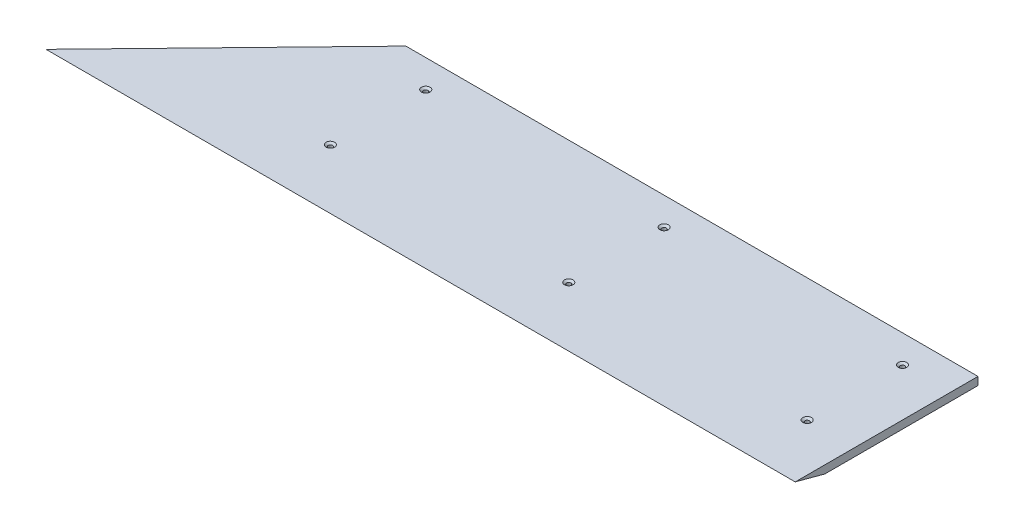
ISO-10303-21;
HEADER;
FILE_DESCRIPTION(('STEP AP214'),'2;1');
FILE_NAME('part.step','',(''),(''),'','','');
FILE_SCHEMA(('AUTOMOTIVE_DESIGN { 1 0 10303 214 1 1 1 1 }'));
ENDSEC;
DATA;
#1=APPLICATION_CONTEXT('core data for automotive mechanical design processes');
#2=APPLICATION_PROTOCOL_DEFINITION('international standard','automotive_design',2000,#1);
#3=PRODUCT_CONTEXT('',#1,'mechanical');
#4=PRODUCT('Part','Part','',(#3));
#5=PRODUCT_RELATED_PRODUCT_CATEGORY('part','',(#4));
#6=PRODUCT_DEFINITION_FORMATION('','',#4);
#7=PRODUCT_DEFINITION_CONTEXT('part definition',#1,'design');
#8=PRODUCT_DEFINITION('design','',#6,#7);
#9=PRODUCT_DEFINITION_SHAPE('','',#8);
#10=(LENGTH_UNIT() NAMED_UNIT(*) SI_UNIT(.MILLI.,.METRE.));
#11=(NAMED_UNIT(*) PLANE_ANGLE_UNIT() SI_UNIT($,.RADIAN.));
#12=(NAMED_UNIT(*) SI_UNIT($,.STERADIAN.) SOLID_ANGLE_UNIT());
#13=UNCERTAINTY_MEASURE_WITH_UNIT(LENGTH_MEASURE(1.E-05),#10,'distance_accuracy_value','');
#14=(GEOMETRIC_REPRESENTATION_CONTEXT(3) GLOBAL_UNCERTAINTY_ASSIGNED_CONTEXT((#13)) GLOBAL_UNIT_ASSIGNED_CONTEXT((#10,
#11,#12)) REPRESENTATION_CONTEXT('',''));
#15=CARTESIAN_POINT('',(0.,0.,0.));
#16=DIRECTION('',(0.,0.,1.));
#17=DIRECTION('',(1.,0.,0.));
#18=AXIS2_PLACEMENT_3D('',#15,#16,#17);
#19=CARTESIAN_POINT('',(381.,12.7,196.85));
#20=DIRECTION('',(0.,1.,0.));
#21=DIRECTION('',(0.,0.,1.));
#22=AXIS2_PLACEMENT_3D('',#19,#20,#21);
#23=CONICAL_SURFACE('',#22,6.85799999999998,0.872664625997165);
#24=CARTESIAN_POINT('',(381.,9.94208089623176,196.85));
#25=DIRECTION('',(0.,1.,0.));
#26=DIRECTION('',(0.,0.,1.));
#27=AXIS2_PLACEMENT_3D('',#24,#25,#26);
#28=CIRCLE('',#27,3.57123999999998);
#29=CARTESIAN_POINT('',(381.,9.94208089623176,200.42124));
#30=VERTEX_POINT('',#29);
#31=EDGE_CURVE('E11',#30,#30,#28,.T.);
#32=ORIENTED_EDGE('',*,*,#31,.F.);
#33=EDGE_LOOP('',(#32));
#34=FACE_BOUND('',#33,.T.);
#35=CARTESIAN_POINT('',(381.,12.7,196.85));
#36=DIRECTION('',(0.,1.,0.));
#37=DIRECTION('',(0.,0.,1.));
#38=AXIS2_PLACEMENT_3D('',#35,#36,#37);
#39=CIRCLE('',#38,6.85799999999998);
#40=CARTESIAN_POINT('',(381.,12.7,203.708));
#41=VERTEX_POINT('',#40);
#42=EDGE_CURVE('E120',#41,#41,#39,.T.);
#43=ORIENTED_EDGE('',*,*,#42,.T.);
#44=EDGE_LOOP('',(#43));
#45=FACE_BOUND('',#44,.T.);
#46=ADVANCED_FACE('F32',(#34,#45),#23,.F.);
#47=CARTESIAN_POINT('',(381.,12.7,196.85));
#48=DIRECTION('',(0.,1.,0.));
#49=DIRECTION('',(0.,0.,1.));
#50=AXIS2_PLACEMENT_3D('',#47,#48,#49);
#51=CYLINDRICAL_SURFACE('',#50,3.57123999999998);
#52=CARTESIAN_POINT('',(381.,0.,196.85));
#53=DIRECTION('',(0.,1.,0.));
#54=DIRECTION('',(0.,0.,1.));
#55=AXIS2_PLACEMENT_3D('',#52,#53,#54);
#56=CIRCLE('',#55,3.57123999999998);
#57=CARTESIAN_POINT('',(381.,0.,200.42124));
#58=VERTEX_POINT('',#57);
#59=EDGE_CURVE('E39',#58,#58,#56,.T.);
#60=ORIENTED_EDGE('',*,*,#59,.F.);
#61=EDGE_LOOP('',(#60));
#62=FACE_BOUND('',#61,.T.);
#63=ORIENTED_EDGE('',*,*,#31,.T.);
#64=EDGE_LOOP('',(#63));
#65=FACE_BOUND('',#64,.T.);
#66=ADVANCED_FACE('F127',(#62,#65),#51,.F.);
#67=CARTESIAN_POINT('',(381.,12.7,44.4499999999998));
#68=DIRECTION('',(0.,1.,0.));
#69=DIRECTION('',(0.,0.,1.));
#70=AXIS2_PLACEMENT_3D('',#67,#68,#69);
#71=CONICAL_SURFACE('',#70,6.85799999999998,0.872664625997165);
#72=CARTESIAN_POINT('',(381.,9.94208089623176,44.4499999999998));
#73=DIRECTION('',(0.,1.,0.));
#74=DIRECTION('',(0.,0.,1.));
#75=AXIS2_PLACEMENT_3D('',#72,#73,#74);
#76=CIRCLE('',#75,3.57123999999998);
#77=CARTESIAN_POINT('',(381.,9.94208089623176,48.0212399999997));
#78=VERTEX_POINT('',#77);
#79=EDGE_CURVE('E117',#78,#78,#76,.T.);
#80=ORIENTED_EDGE('',*,*,#79,.F.);
#81=EDGE_LOOP('',(#80));
#82=FACE_BOUND('',#81,.T.);
#83=CARTESIAN_POINT('',(381.,12.7,44.4499999999998));
#84=DIRECTION('',(0.,1.,0.));
#85=DIRECTION('',(0.,0.,1.));
#86=AXIS2_PLACEMENT_3D('',#83,#84,#85);
#87=CIRCLE('',#86,6.85799999999998);
#88=CARTESIAN_POINT('',(381.,12.7,51.3079999999997));
#89=VERTEX_POINT('',#88);
#90=EDGE_CURVE('E81',#89,#89,#87,.T.);
#91=ORIENTED_EDGE('',*,*,#90,.T.);
#92=EDGE_LOOP('',(#91));
#93=FACE_BOUND('',#92,.T.);
#94=ADVANCED_FACE('F130',(#82,#93),#71,.F.);
#95=CARTESIAN_POINT('',(381.,12.7,44.4499999999998));
#96=DIRECTION('',(0.,1.,0.));
#97=DIRECTION('',(0.,0.,1.));
#98=AXIS2_PLACEMENT_3D('',#95,#96,#97);
#99=CYLINDRICAL_SURFACE('',#98,3.57123999999998);
#100=CARTESIAN_POINT('',(381.,0.,44.4499999999998));
#101=DIRECTION('',(0.,1.,0.));
#102=DIRECTION('',(0.,0.,1.));
#103=AXIS2_PLACEMENT_3D('',#100,#101,#102);
#104=CIRCLE('',#103,3.57123999999998);
#105=CARTESIAN_POINT('',(381.,0.,48.0212399999997));
#106=VERTEX_POINT('',#105);
#107=EDGE_CURVE('E114',#106,#106,#104,.T.);
#108=ORIENTED_EDGE('',*,*,#107,.F.);
#109=EDGE_LOOP('',(#108));
#110=FACE_BOUND('',#109,.T.);
#111=ORIENTED_EDGE('',*,*,#79,.T.);
#112=EDGE_LOOP('',(#111));
#113=FACE_BOUND('',#112,.T.);
#114=ADVANCED_FACE('F160',(#110,#113),#99,.F.);
#115=CARTESIAN_POINT('',(-740.26459256231,12.7,292.1));
#116=DIRECTION('',(0.718126297763185,0.,0.695912796592318));
#117=DIRECTION('',(0.695912796592318,0.,-0.718126297763185));
#118=AXIS2_PLACEMENT_3D('',#115,#116,#117);
#119=PLANE('',#118);
#120=DIRECTION('',(-0.695912796592318,0.,0.718126297763185));
#121=VECTOR('',#120,1.);
#122=CARTESIAN_POINT('',(-740.26459256231,0.,292.1));
#123=LINE('',#122,#121);
#124=CARTESIAN_POINT('',(-457.2,0.,0.));
#125=VERTEX_POINT('',#124);
#126=CARTESIAN_POINT('',(-694.33366033334,0.,244.702954743876));
#127=VERTEX_POINT('',#126);
#128=EDGE_CURVE('E78',#125,#127,#123,.T.);
#129=ORIENTED_EDGE('',*,*,#128,.T.);
#130=DIRECTION('',(-0.683376443185712,0.188955033292019,0.705189784591678));
#131=VECTOR('',#130,1.);
#132=CARTESIAN_POINT('',(-181.044600641157,-141.925511670305,-284.970265699909));
#133=LINE('',#132,#131);
#134=CARTESIAN_POINT('',(-740.26459256231,12.7,292.1));
#135=VERTEX_POINT('',#134);
#136=EDGE_CURVE('E73',#127,#135,#133,.T.);
#137=ORIENTED_EDGE('',*,*,#136,.T.);
#138=DIRECTION('',(-0.695912796592318,0.,0.718126297763185));
#139=VECTOR('',#138,1.);
#140=CARTESIAN_POINT('',(-740.26459256231,12.7,292.1));
#141=LINE('',#140,#139);
#142=CARTESIAN_POINT('',(-457.2,12.7,0.));
#143=VERTEX_POINT('',#142);
#144=EDGE_CURVE('E77',#143,#135,#141,.T.);
#145=ORIENTED_EDGE('',*,*,#144,.F.);
#146=DIRECTION('',(0.,-1.,0.));
#147=VECTOR('',#146,1.);
#148=CARTESIAN_POINT('',(-457.2,12.7,0.));
#149=LINE('',#148,#147);
#150=EDGE_CURVE('E100',#143,#125,#149,.T.);
#151=ORIENTED_EDGE('',*,*,#150,.T.);
#152=EDGE_LOOP('',(#129,#137,#145,#151));
#153=FACE_BOUND('',#152,.T.);
#154=ADVANCED_FACE('F75',(#153),#119,.F.);
#155=CARTESIAN_POINT('',(457.2,12.7,-1.67972554971051E-13));
#156=DIRECTION('',(-1.,0.,0.));
#157=DIRECTION('',(0.,0.,1.));
#158=AXIS2_PLACEMENT_3D('',#155,#156,#157);
#159=PLANE('',#158);
#160=DIRECTION('',(0.,0.,-1.));
#161=VECTOR('',#160,1.);
#162=CARTESIAN_POINT('',(457.2,12.7,-1.67972554971051E-13));
#163=LINE('',#162,#161);
#164=CARTESIAN_POINT('',(457.2,12.7,292.1));
#165=VERTEX_POINT('',#164);
#166=CARTESIAN_POINT('',(457.2,12.7,-1.67972554971051E-13));
#167=VERTEX_POINT('',#166);
#168=EDGE_CURVE('E94',#165,#167,#163,.T.);
#169=ORIENTED_EDGE('',*,*,#168,.F.);
#170=DIRECTION('',(0.,-0.258819045102523,-0.965925826289068));
#171=VECTOR('',#170,1.);
#172=CARTESIAN_POINT('',(457.2,12.7,292.1));
#173=LINE('',#172,#171);
#174=CARTESIAN_POINT('',(457.2,0.,244.702954743876));
#175=VERTEX_POINT('',#174);
#176=EDGE_CURVE('E54',#165,#175,#173,.T.);
#177=ORIENTED_EDGE('',*,*,#176,.T.);
#178=DIRECTION('',(0.,0.,-1.));
#179=VECTOR('',#178,1.);
#180=CARTESIAN_POINT('',(457.2,0.,-1.67972554971051E-13));
#181=LINE('',#180,#179);
#182=CARTESIAN_POINT('',(457.2,0.,-1.67972554971051E-13));
#183=VERTEX_POINT('',#182);
#184=EDGE_CURVE('E102',#175,#183,#181,.T.);
#185=ORIENTED_EDGE('',*,*,#184,.T.);
#186=DIRECTION('',(0.,-1.,0.));
#187=VECTOR('',#186,1.);
#188=CARTESIAN_POINT('',(457.2,12.7,-1.67972554971051E-13));
#189=LINE('',#188,#187);
#190=EDGE_CURVE('E107',#167,#183,#189,.T.);
#191=ORIENTED_EDGE('',*,*,#190,.F.);
#192=EDGE_LOOP('',(#169,#177,#185,#191));
#193=FACE_BOUND('',#192,.T.);
#194=ADVANCED_FACE('F147',(#193),#159,.F.);
#195=CARTESIAN_POINT('',(-457.2,12.7,0.));
#196=DIRECTION('',(0.,0.,1.));
#197=DIRECTION('',(1.,0.,0.));
#198=AXIS2_PLACEMENT_3D('',#195,#196,#197);
#199=PLANE('',#198);
#200=DIRECTION('',(-1.,0.,0.));
#201=VECTOR('',#200,1.);
#202=CARTESIAN_POINT('',(-457.2,0.,0.));
#203=LINE('',#202,#201);
#204=EDGE_CURVE('E91',#183,#125,#203,.T.);
#205=ORIENTED_EDGE('',*,*,#204,.T.);
#206=ORIENTED_EDGE('',*,*,#150,.F.);
#207=DIRECTION('',(-1.,0.,0.));
#208=VECTOR('',#207,1.);
#209=CARTESIAN_POINT('',(-457.2,12.7,0.));
#210=LINE('',#209,#208);
#211=EDGE_CURVE('E89',#167,#143,#210,.T.);
#212=ORIENTED_EDGE('',*,*,#211,.F.);
#213=ORIENTED_EDGE('',*,*,#190,.T.);
#214=EDGE_LOOP('',(#205,#206,#212,#213));
#215=FACE_BOUND('',#214,.T.);
#216=ADVANCED_FACE('F138',(#215),#199,.F.);
#217=CARTESIAN_POINT('',(0.,12.7,0.));
#218=DIRECTION('',(0.,-1.,0.));
#219=DIRECTION('',(0.,0.,-1.));
#220=AXIS2_PLACEMENT_3D('',#217,#218,#219);
#221=PLANE('',#220);
#222=CARTESIAN_POINT('',(0.,12.7,196.85));
#223=DIRECTION('',(0.,1.,0.));
#224=DIRECTION('',(0.,0.,1.));
#225=AXIS2_PLACEMENT_3D('',#222,#223,#224);
#226=CIRCLE('',#225,6.85799999999998);
#227=CARTESIAN_POINT('',(0.,12.7,203.708));
#228=VERTEX_POINT('',#227);
#229=EDGE_CURVE('E309',#228,#228,#226,.T.);
#230=ORIENTED_EDGE('',*,*,#229,.F.);
#231=EDGE_LOOP('',(#230));
#232=FACE_BOUND('',#231,.T.);
#233=CARTESIAN_POINT('',(0.,12.7,44.4499999999998));
#234=DIRECTION('',(0.,1.,0.));
#235=DIRECTION('',(0.,0.,1.));
#236=AXIS2_PLACEMENT_3D('',#233,#234,#235);
#237=CIRCLE('',#236,6.85799999999998);
#238=CARTESIAN_POINT('',(0.,12.7,51.3079999999998));
#239=VERTEX_POINT('',#238);
#240=EDGE_CURVE('E316',#239,#239,#237,.T.);
#241=ORIENTED_EDGE('',*,*,#240,.F.);
#242=EDGE_LOOP('',(#241));
#243=FACE_BOUND('',#242,.T.);
#244=CARTESIAN_POINT('',(-381.,12.7,44.4499999999998));
#245=DIRECTION('',(0.,1.,0.));
#246=DIRECTION('',(0.,0.,1.));
#247=AXIS2_PLACEMENT_3D('',#244,#245,#246);
#248=CIRCLE('',#247,6.85799999999998);
#249=CARTESIAN_POINT('',(-381.,12.7,51.3079999999998));
#250=VERTEX_POINT('',#249);
#251=EDGE_CURVE('E325',#250,#250,#248,.T.);
#252=ORIENTED_EDGE('',*,*,#251,.F.);
#253=EDGE_LOOP('',(#252));
#254=FACE_BOUND('',#253,.T.);
#255=CARTESIAN_POINT('',(-381.,12.7,196.85));
#256=DIRECTION('',(0.,1.,0.));
#257=DIRECTION('',(0.,0.,1.));
#258=AXIS2_PLACEMENT_3D('',#255,#256,#257);
#259=CIRCLE('',#258,6.85799999999998);
#260=CARTESIAN_POINT('',(-381.,12.7,203.708));
#261=VERTEX_POINT('',#260);
#262=EDGE_CURVE('E334',#261,#261,#259,.T.);
#263=ORIENTED_EDGE('',*,*,#262,.F.);
#264=EDGE_LOOP('',(#263));
#265=FACE_BOUND('',#264,.T.);
#266=ORIENTED_EDGE('',*,*,#144,.T.);
#267=DIRECTION('',(1.,0.,0.));
#268=VECTOR('',#267,1.);
#269=CARTESIAN_POINT('',(457.2,12.7,292.1));
#270=LINE('',#269,#268);
#271=EDGE_CURVE('E87',#135,#165,#270,.T.);
#272=ORIENTED_EDGE('',*,*,#271,.T.);
#273=ORIENTED_EDGE('',*,*,#168,.T.);
#274=ORIENTED_EDGE('',*,*,#211,.T.);
#275=EDGE_LOOP('',(#266,#272,#273,#274));
#276=FACE_BOUND('',#275,.T.);
#277=ORIENTED_EDGE('',*,*,#90,.F.);
#278=EDGE_LOOP('',(#277));
#279=FACE_BOUND('',#278,.T.);
#280=ORIENTED_EDGE('',*,*,#42,.F.);
#281=EDGE_LOOP('',(#280));
#282=FACE_BOUND('',#281,.T.);
#283=ADVANCED_FACE('F85',(#232,#243,#254,#265,#276,#279,#282),#221,.F.);
#284=CARTESIAN_POINT('',(0.,0.,0.));
#285=DIRECTION('',(0.,-1.,0.));
#286=DIRECTION('',(0.,0.,-1.));
#287=AXIS2_PLACEMENT_3D('',#284,#285,#286);
#288=PLANE('',#287);
#289=CARTESIAN_POINT('',(0.,0.,196.85));
#290=DIRECTION('',(0.,1.,0.));
#291=DIRECTION('',(0.,0.,1.));
#292=AXIS2_PLACEMENT_3D('',#289,#290,#291);
#293=CIRCLE('',#292,3.57123999999998);
#294=CARTESIAN_POINT('',(0.,0.,200.42124));
#295=VERTEX_POINT('',#294);
#296=EDGE_CURVE('E310',#295,#295,#293,.T.);
#297=ORIENTED_EDGE('',*,*,#296,.T.);
#298=EDGE_LOOP('',(#297));
#299=FACE_BOUND('',#298,.T.);
#300=CARTESIAN_POINT('',(0.,0.,44.4499999999998));
#301=DIRECTION('',(0.,1.,0.));
#302=DIRECTION('',(0.,0.,1.));
#303=AXIS2_PLACEMENT_3D('',#300,#301,#302);
#304=CIRCLE('',#303,3.57123999999998);
#305=CARTESIAN_POINT('',(0.,0.,48.0212399999998));
#306=VERTEX_POINT('',#305);
#307=EDGE_CURVE('E319',#306,#306,#304,.T.);
#308=ORIENTED_EDGE('',*,*,#307,.T.);
#309=EDGE_LOOP('',(#308));
#310=FACE_BOUND('',#309,.T.);
#311=CARTESIAN_POINT('',(-381.,0.,44.4499999999998));
#312=DIRECTION('',(0.,1.,0.));
#313=DIRECTION('',(0.,0.,1.));
#314=AXIS2_PLACEMENT_3D('',#311,#312,#313);
#315=CIRCLE('',#314,3.57123999999998);
#316=CARTESIAN_POINT('',(-381.,0.,48.0212399999998));
#317=VERTEX_POINT('',#316);
#318=EDGE_CURVE('E331',#317,#317,#315,.T.);
#319=ORIENTED_EDGE('',*,*,#318,.T.);
#320=EDGE_LOOP('',(#319));
#321=FACE_BOUND('',#320,.T.);
#322=CARTESIAN_POINT('',(-381.,0.,196.85));
#323=DIRECTION('',(0.,1.,0.));
#324=DIRECTION('',(0.,0.,1.));
#325=AXIS2_PLACEMENT_3D('',#322,#323,#324);
#326=CIRCLE('',#325,3.57123999999998);
#327=CARTESIAN_POINT('',(-381.,0.,200.42124));
#328=VERTEX_POINT('',#327);
#329=EDGE_CURVE('E103',#328,#328,#326,.T.);
#330=ORIENTED_EDGE('',*,*,#329,.T.);
#331=EDGE_LOOP('',(#330));
#332=FACE_BOUND('',#331,.T.);
#333=ORIENTED_EDGE('',*,*,#184,.F.);
#334=DIRECTION('',(-1.,0.,0.));
#335=VECTOR('',#334,1.);
#336=CARTESIAN_POINT('',(-740.26459256231,0.,244.702954743876));
#337=LINE('',#336,#335);
#338=EDGE_CURVE('E46',#175,#127,#337,.T.);
#339=ORIENTED_EDGE('',*,*,#338,.T.);
#340=ORIENTED_EDGE('',*,*,#128,.F.);
#341=ORIENTED_EDGE('',*,*,#204,.F.);
#342=EDGE_LOOP('',(#333,#339,#340,#341));
#343=FACE_BOUND('',#342,.T.);
#344=ORIENTED_EDGE('',*,*,#107,.T.);
#345=EDGE_LOOP('',(#344));
#346=FACE_BOUND('',#345,.T.);
#347=ORIENTED_EDGE('',*,*,#59,.T.);
#348=EDGE_LOOP('',(#347));
#349=FACE_BOUND('',#348,.T.);
#350=ADVANCED_FACE('F125',(#299,#310,#321,#332,#343,#346,#349),#288,.T.);
#351=CARTESIAN_POINT('',(457.2,12.7,292.1));
#352=DIRECTION('',(0.,-0.965925826289068,0.258819045102523));
#353=DIRECTION('',(-1.,0.,0.));
#354=AXIS2_PLACEMENT_3D('',#351,#352,#353);
#355=PLANE('',#354);
#356=ORIENTED_EDGE('',*,*,#136,.F.);
#357=ORIENTED_EDGE('',*,*,#338,.F.);
#358=ORIENTED_EDGE('',*,*,#176,.F.);
#359=ORIENTED_EDGE('',*,*,#271,.F.);
#360=EDGE_LOOP('',(#356,#357,#358,#359));
#361=FACE_BOUND('',#360,.T.);
#362=ADVANCED_FACE('F93',(#361),#355,.T.);
#363=CARTESIAN_POINT('',(-381.,12.7,196.85));
#364=DIRECTION('',(0.,1.,0.));
#365=DIRECTION('',(0.,0.,1.));
#366=AXIS2_PLACEMENT_3D('',#363,#364,#365);
#367=CYLINDRICAL_SURFACE('',#366,3.57123999999998);
#368=ORIENTED_EDGE('',*,*,#329,.F.);
#369=EDGE_LOOP('',(#368));
#370=FACE_BOUND('',#369,.T.);
#371=CARTESIAN_POINT('',(-381.,9.94208089623176,196.85));
#372=DIRECTION('',(0.,1.,0.));
#373=DIRECTION('',(0.,0.,1.));
#374=AXIS2_PLACEMENT_3D('',#371,#372,#373);
#375=CIRCLE('',#374,3.57123999999998);
#376=CARTESIAN_POINT('',(-381.,9.94208089623176,200.42124));
#377=VERTEX_POINT('',#376);
#378=EDGE_CURVE('E337',#377,#377,#375,.T.);
#379=ORIENTED_EDGE('',*,*,#378,.T.);
#380=EDGE_LOOP('',(#379));
#381=FACE_BOUND('',#380,.T.);
#382=ADVANCED_FACE('F153',(#370,#381),#367,.F.);
#383=CARTESIAN_POINT('',(-381.,12.7,196.85));
#384=DIRECTION('',(0.,1.,0.));
#385=DIRECTION('',(0.,0.,1.));
#386=AXIS2_PLACEMENT_3D('',#383,#384,#385);
#387=CONICAL_SURFACE('',#386,6.85799999999998,0.872664625997165);
#388=ORIENTED_EDGE('',*,*,#378,.F.);
#389=EDGE_LOOP('',(#388));
#390=FACE_BOUND('',#389,.T.);
#391=ORIENTED_EDGE('',*,*,#262,.T.);
#392=EDGE_LOOP('',(#391));
#393=FACE_BOUND('',#392,.T.);
#394=ADVANCED_FACE('F219',(#390,#393),#387,.F.);
#395=CARTESIAN_POINT('',(-381.,12.7,44.4499999999998));
#396=DIRECTION('',(0.,1.,0.));
#397=DIRECTION('',(0.,0.,1.));
#398=AXIS2_PLACEMENT_3D('',#395,#396,#397);
#399=CYLINDRICAL_SURFACE('',#398,3.57123999999998);
#400=ORIENTED_EDGE('',*,*,#318,.F.);
#401=EDGE_LOOP('',(#400));
#402=FACE_BOUND('',#401,.T.);
#403=CARTESIAN_POINT('',(-381.,9.94208089623176,44.4499999999998));
#404=DIRECTION('',(0.,1.,0.));
#405=DIRECTION('',(0.,0.,1.));
#406=AXIS2_PLACEMENT_3D('',#403,#404,#405);
#407=CIRCLE('',#406,3.57123999999998);
#408=CARTESIAN_POINT('',(-381.,9.94208089623176,48.0212399999998));
#409=VERTEX_POINT('',#408);
#410=EDGE_CURVE('E328',#409,#409,#407,.T.);
#411=ORIENTED_EDGE('',*,*,#410,.T.);
#412=EDGE_LOOP('',(#411));
#413=FACE_BOUND('',#412,.T.);
#414=ADVANCED_FACE('F227',(#402,#413),#399,.F.);
#415=CARTESIAN_POINT('',(-381.,12.7,44.4499999999998));
#416=DIRECTION('',(0.,1.,0.));
#417=DIRECTION('',(0.,0.,1.));
#418=AXIS2_PLACEMENT_3D('',#415,#416,#417);
#419=CONICAL_SURFACE('',#418,6.85799999999998,0.872664625997165);
#420=ORIENTED_EDGE('',*,*,#410,.F.);
#421=EDGE_LOOP('',(#420));
#422=FACE_BOUND('',#421,.T.);
#423=ORIENTED_EDGE('',*,*,#251,.T.);
#424=EDGE_LOOP('',(#423));
#425=FACE_BOUND('',#424,.T.);
#426=ADVANCED_FACE('F235',(#422,#425),#419,.F.);
#427=CARTESIAN_POINT('',(0.,12.7,44.4499999999998));
#428=DIRECTION('',(0.,1.,0.));
#429=DIRECTION('',(0.,0.,1.));
#430=AXIS2_PLACEMENT_3D('',#427,#428,#429);
#431=CYLINDRICAL_SURFACE('',#430,3.57123999999998);
#432=ORIENTED_EDGE('',*,*,#307,.F.);
#433=EDGE_LOOP('',(#432));
#434=FACE_BOUND('',#433,.T.);
#435=CARTESIAN_POINT('',(0.,9.94208089623176,44.4499999999998));
#436=DIRECTION('',(0.,1.,0.));
#437=DIRECTION('',(0.,0.,1.));
#438=AXIS2_PLACEMENT_3D('',#435,#436,#437);
#439=CIRCLE('',#438,3.57123999999998);
#440=CARTESIAN_POINT('',(0.,9.94208089623176,48.0212399999998));
#441=VERTEX_POINT('',#440);
#442=EDGE_CURVE('E322',#441,#441,#439,.T.);
#443=ORIENTED_EDGE('',*,*,#442,.T.);
#444=EDGE_LOOP('',(#443));
#445=FACE_BOUND('',#444,.T.);
#446=ADVANCED_FACE('F244',(#434,#445),#431,.F.);
#447=CARTESIAN_POINT('',(0.,12.7,44.4499999999998));
#448=DIRECTION('',(0.,1.,0.));
#449=DIRECTION('',(0.,0.,1.));
#450=AXIS2_PLACEMENT_3D('',#447,#448,#449);
#451=CONICAL_SURFACE('',#450,6.85799999999998,0.872664625997165);
#452=ORIENTED_EDGE('',*,*,#442,.F.);
#453=EDGE_LOOP('',(#452));
#454=FACE_BOUND('',#453,.T.);
#455=ORIENTED_EDGE('',*,*,#240,.T.);
#456=EDGE_LOOP('',(#455));
#457=FACE_BOUND('',#456,.T.);
#458=ADVANCED_FACE('F265',(#454,#457),#451,.F.);
#459=CARTESIAN_POINT('',(0.,12.7,196.85));
#460=DIRECTION('',(0.,1.,0.));
#461=DIRECTION('',(0.,0.,1.));
#462=AXIS2_PLACEMENT_3D('',#459,#460,#461);
#463=CYLINDRICAL_SURFACE('',#462,3.57123999999998);
#464=ORIENTED_EDGE('',*,*,#296,.F.);
#465=EDGE_LOOP('',(#464));
#466=FACE_BOUND('',#465,.T.);
#467=CARTESIAN_POINT('',(0.,9.94208089623176,196.85));
#468=DIRECTION('',(0.,1.,0.));
#469=DIRECTION('',(0.,0.,1.));
#470=AXIS2_PLACEMENT_3D('',#467,#468,#469);
#471=CIRCLE('',#470,3.57123999999998);
#472=CARTESIAN_POINT('',(0.,9.94208089623176,200.42124));
#473=VERTEX_POINT('',#472);
#474=EDGE_CURVE('E307',#473,#473,#471,.T.);
#475=ORIENTED_EDGE('',*,*,#474,.T.);
#476=EDGE_LOOP('',(#475));
#477=FACE_BOUND('',#476,.T.);
#478=ADVANCED_FACE('F274',(#466,#477),#463,.F.);
#479=CARTESIAN_POINT('',(0.,12.7,196.85));
#480=DIRECTION('',(0.,1.,0.));
#481=DIRECTION('',(0.,0.,1.));
#482=AXIS2_PLACEMENT_3D('',#479,#480,#481);
#483=CONICAL_SURFACE('',#482,6.85799999999998,0.872664625997165);
#484=ORIENTED_EDGE('',*,*,#474,.F.);
#485=EDGE_LOOP('',(#484));
#486=FACE_BOUND('',#485,.T.);
#487=ORIENTED_EDGE('',*,*,#229,.T.);
#488=EDGE_LOOP('',(#487));
#489=FACE_BOUND('',#488,.T.);
#490=ADVANCED_FACE('F283',(#486,#489),#483,.F.);
#491=CLOSED_SHELL('',(#46,#66,#94,#114,#154,#194,#216,#283,#350,#362,#382,#394,#414,#426,#446,
#458,#478,#490));
#492=MANIFOLD_SOLID_BREP('B2',#491);
#493=ADVANCED_BREP_SHAPE_REPRESENTATION('',(#18,#492),#14);
#494=SHAPE_DEFINITION_REPRESENTATION(#9,#493);
ENDSEC;
END-ISO-10303-21;
